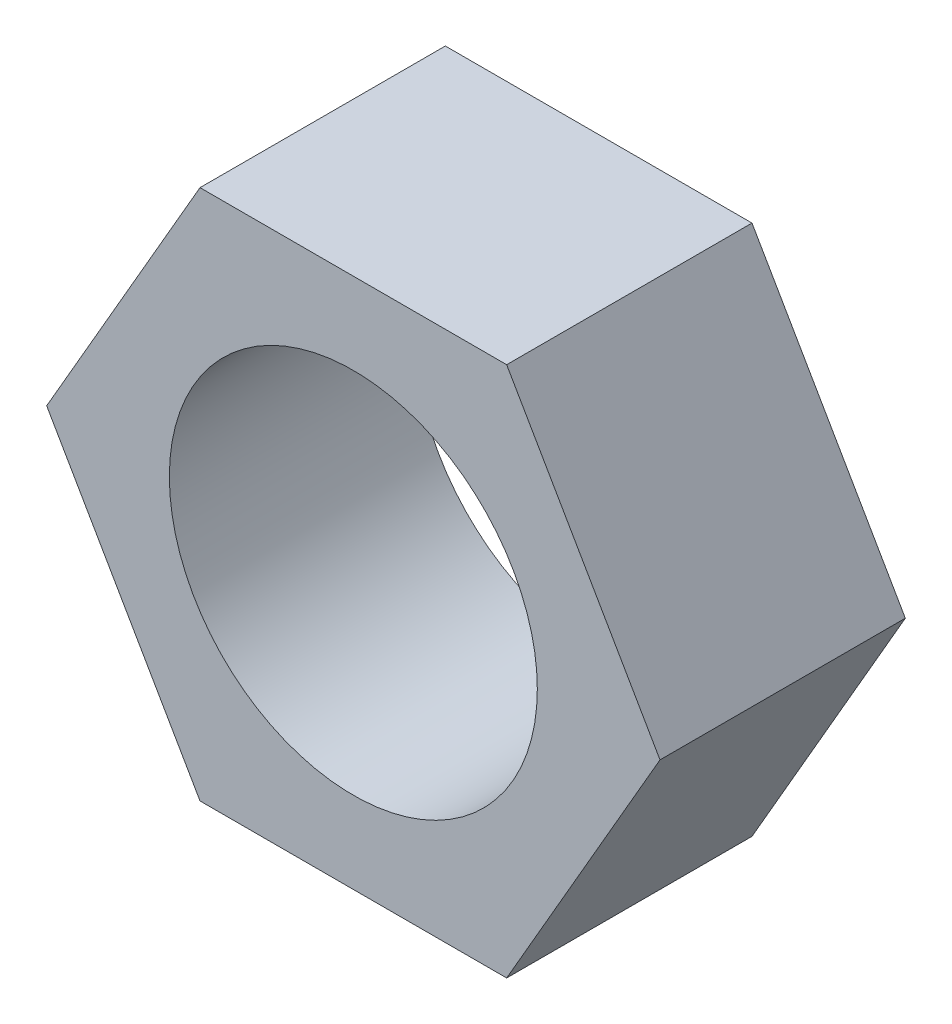
ISO-10303-21;
HEADER;
FILE_DESCRIPTION(('STEP AP214'),'2;1');
FILE_NAME('part.step','',(''),(''),'','','');
FILE_SCHEMA(('AUTOMOTIVE_DESIGN { 1 0 10303 214 1 1 1 1 }'));
ENDSEC;
DATA;
#1=APPLICATION_CONTEXT('core data for automotive mechanical design processes');
#2=APPLICATION_PROTOCOL_DEFINITION('international standard','automotive_design',2000,#1);
#3=PRODUCT_CONTEXT('',#1,'mechanical');
#4=PRODUCT('Part','Part','',(#3));
#5=PRODUCT_RELATED_PRODUCT_CATEGORY('part','',(#4));
#6=PRODUCT_DEFINITION_FORMATION('','',#4);
#7=PRODUCT_DEFINITION_CONTEXT('part definition',#1,'design');
#8=PRODUCT_DEFINITION('design','',#6,#7);
#9=PRODUCT_DEFINITION_SHAPE('','',#8);
#10=(LENGTH_UNIT() NAMED_UNIT(*) SI_UNIT(.MILLI.,.METRE.));
#11=(NAMED_UNIT(*) PLANE_ANGLE_UNIT() SI_UNIT($,.RADIAN.));
#12=(NAMED_UNIT(*) SI_UNIT($,.STERADIAN.) SOLID_ANGLE_UNIT());
#13=UNCERTAINTY_MEASURE_WITH_UNIT(LENGTH_MEASURE(1.E-05),#10,'distance_accuracy_value','');
#14=(GEOMETRIC_REPRESENTATION_CONTEXT(3) GLOBAL_UNCERTAINTY_ASSIGNED_CONTEXT((#13)) GLOBAL_UNIT_ASSIGNED_CONTEXT((#10,
#11,#12)) REPRESENTATION_CONTEXT('',''));
#15=CARTESIAN_POINT('',(0.,0.,0.));
#16=DIRECTION('',(0.,0.,1.));
#17=DIRECTION('',(1.,0.,0.));
#18=AXIS2_PLACEMENT_3D('',#15,#16,#17);
#19=CARTESIAN_POINT('',(2.50000000000005,-4.33012701892216,4.));
#20=DIRECTION('',(-0.866025403784442,0.499999999999995,0.));
#21=DIRECTION('',(-0.499999999999995,-0.866025403784442,0.));
#22=AXIS2_PLACEMENT_3D('',#19,#20,#21);
#23=PLANE('',#22);
#24=DIRECTION('',(0.499999999999995,0.866025403784442,0.));
#25=VECTOR('',#24,1.);
#26=CARTESIAN_POINT('',(2.50000000000005,-4.33012701892216,0.));
#27=LINE('',#26,#25);
#28=CARTESIAN_POINT('',(2.50000000000005,-4.33012701892216,0.));
#29=VERTEX_POINT('',#28);
#30=CARTESIAN_POINT('',(5.,0.,0.));
#31=VERTEX_POINT('',#30);
#32=EDGE_CURVE('E118',#29,#31,#27,.T.);
#33=ORIENTED_EDGE('',*,*,#32,.T.);
#34=DIRECTION('',(0.,0.,-1.));
#35=VECTOR('',#34,1.);
#36=CARTESIAN_POINT('',(5.,0.,4.));
#37=LINE('',#36,#35);
#38=CARTESIAN_POINT('',(5.,0.,4.));
#39=VERTEX_POINT('',#38);
#40=EDGE_CURVE('E11',#39,#31,#37,.T.);
#41=ORIENTED_EDGE('',*,*,#40,.F.);
#42=DIRECTION('',(0.499999999999995,0.866025403784442,0.));
#43=VECTOR('',#42,1.);
#44=CARTESIAN_POINT('',(2.50000000000005,-4.33012701892216,4.));
#45=LINE('',#44,#43);
#46=CARTESIAN_POINT('',(2.50000000000005,-4.33012701892216,4.));
#47=VERTEX_POINT('',#46);
#48=EDGE_CURVE('E129',#47,#39,#45,.T.);
#49=ORIENTED_EDGE('',*,*,#48,.F.);
#50=DIRECTION('',(0.,0.,-1.));
#51=VECTOR('',#50,1.);
#52=CARTESIAN_POINT('',(2.50000000000005,-4.33012701892216,4.));
#53=LINE('',#52,#51);
#54=EDGE_CURVE('E114',#47,#29,#53,.T.);
#55=ORIENTED_EDGE('',*,*,#54,.T.);
#56=EDGE_LOOP('',(#33,#41,#49,#55));
#57=FACE_BOUND('',#56,.T.);
#58=ADVANCED_FACE('F34',(#57),#23,.F.);
#59=CARTESIAN_POINT('',(5.,0.,4.));
#60=DIRECTION('',(-0.866025403784438,-0.500000000000001,0.));
#61=DIRECTION('',(0.500000000000001,-0.866025403784438,0.));
#62=AXIS2_PLACEMENT_3D('',#59,#60,#61);
#63=PLANE('',#62);
#64=DIRECTION('',(-0.500000000000001,0.866025403784438,0.));
#65=VECTOR('',#64,1.);
#66=CARTESIAN_POINT('',(5.,0.,0.));
#67=LINE('',#66,#65);
#68=CARTESIAN_POINT('',(2.49999999999999,4.3301270189222,0.));
#69=VERTEX_POINT('',#68);
#70=EDGE_CURVE('E121',#31,#69,#67,.T.);
#71=ORIENTED_EDGE('',*,*,#70,.T.);
#72=DIRECTION('',(0.,0.,-1.));
#73=VECTOR('',#72,1.);
#74=CARTESIAN_POINT('',(2.49999999999999,4.3301270189222,4.));
#75=LINE('',#74,#73);
#76=CARTESIAN_POINT('',(2.49999999999999,4.3301270189222,4.));
#77=VERTEX_POINT('',#76);
#78=EDGE_CURVE('E42',#77,#69,#75,.T.);
#79=ORIENTED_EDGE('',*,*,#78,.F.);
#80=DIRECTION('',(-0.500000000000001,0.866025403784438,0.));
#81=VECTOR('',#80,1.);
#82=CARTESIAN_POINT('',(5.,0.,4.));
#83=LINE('',#82,#81);
#84=EDGE_CURVE('E87',#39,#77,#83,.T.);
#85=ORIENTED_EDGE('',*,*,#84,.F.);
#86=ORIENTED_EDGE('',*,*,#40,.T.);
#87=EDGE_LOOP('',(#71,#79,#85,#86));
#88=FACE_BOUND('',#87,.T.);
#89=ADVANCED_FACE('F154',(#88),#63,.F.);
#90=CARTESIAN_POINT('',(2.49999999999999,4.3301270189222,4.));
#91=DIRECTION('',(0.,-1.,0.));
#92=DIRECTION('',(1.,0.,0.));
#93=AXIS2_PLACEMENT_3D('',#90,#91,#92);
#94=PLANE('',#93);
#95=DIRECTION('',(-1.,0.,0.));
#96=VECTOR('',#95,1.);
#97=CARTESIAN_POINT('',(2.49999999999999,4.3301270189222,0.));
#98=LINE('',#97,#96);
#99=CARTESIAN_POINT('',(-2.50000000000002,4.33012701892218,0.));
#100=VERTEX_POINT('',#99);
#101=EDGE_CURVE('E124',#69,#100,#98,.T.);
#102=ORIENTED_EDGE('',*,*,#101,.T.);
#103=DIRECTION('',(0.,0.,-1.));
#104=VECTOR('',#103,1.);
#105=CARTESIAN_POINT('',(-2.50000000000002,4.33012701892218,4.));
#106=LINE('',#105,#104);
#107=CARTESIAN_POINT('',(-2.50000000000002,4.33012701892218,4.));
#108=VERTEX_POINT('',#107);
#109=EDGE_CURVE('E109',#108,#100,#106,.T.);
#110=ORIENTED_EDGE('',*,*,#109,.F.);
#111=DIRECTION('',(-1.,0.,0.));
#112=VECTOR('',#111,1.);
#113=CARTESIAN_POINT('',(2.49999999999999,4.3301270189222,4.));
#114=LINE('',#113,#112);
#115=EDGE_CURVE('E100',#77,#108,#114,.T.);
#116=ORIENTED_EDGE('',*,*,#115,.F.);
#117=ORIENTED_EDGE('',*,*,#78,.T.);
#118=EDGE_LOOP('',(#102,#110,#116,#117));
#119=FACE_BOUND('',#118,.T.);
#120=ADVANCED_FACE('F135',(#119),#94,.F.);
#121=CARTESIAN_POINT('',(-2.50000000000002,4.33012701892218,4.));
#122=DIRECTION('',(0.866025403784442,-0.499999999999995,0.));
#123=DIRECTION('',(0.499999999999995,0.866025403784442,0.));
#124=AXIS2_PLACEMENT_3D('',#121,#122,#123);
#125=PLANE('',#124);
#126=DIRECTION('',(-0.499999999999995,-0.866025403784442,0.));
#127=VECTOR('',#126,1.);
#128=CARTESIAN_POINT('',(-2.50000000000002,4.33012701892218,0.));
#129=LINE('',#128,#127);
#130=CARTESIAN_POINT('',(-5.,0.,0.));
#131=VERTEX_POINT('',#130);
#132=EDGE_CURVE('E108',#100,#131,#129,.T.);
#133=ORIENTED_EDGE('',*,*,#132,.T.);
#134=DIRECTION('',(0.,0.,-1.));
#135=VECTOR('',#134,1.);
#136=CARTESIAN_POINT('',(-5.,0.,4.));
#137=LINE('',#136,#135);
#138=CARTESIAN_POINT('',(-5.,0.,4.));
#139=VERTEX_POINT('',#138);
#140=EDGE_CURVE('E105',#139,#131,#137,.T.);
#141=ORIENTED_EDGE('',*,*,#140,.F.);
#142=DIRECTION('',(-0.499999999999995,-0.866025403784442,0.));
#143=VECTOR('',#142,1.);
#144=CARTESIAN_POINT('',(-2.50000000000002,4.33012701892218,4.));
#145=LINE('',#144,#143);
#146=EDGE_CURVE('E94',#108,#139,#145,.T.);
#147=ORIENTED_EDGE('',*,*,#146,.F.);
#148=ORIENTED_EDGE('',*,*,#109,.T.);
#149=EDGE_LOOP('',(#133,#141,#147,#148));
#150=FACE_BOUND('',#149,.T.);
#151=ADVANCED_FACE('F106',(#150),#125,.F.);
#152=CARTESIAN_POINT('',(-5.,0.,4.));
#153=DIRECTION('',(0.866025403784435,0.500000000000007,0.));
#154=DIRECTION('',(-0.500000000000007,0.866025403784435,0.));
#155=AXIS2_PLACEMENT_3D('',#152,#153,#154);
#156=PLANE('',#155);
#157=DIRECTION('',(0.500000000000007,-0.866025403784435,0.));
#158=VECTOR('',#157,1.);
#159=CARTESIAN_POINT('',(-5.,0.,0.));
#160=LINE('',#159,#158);
#161=CARTESIAN_POINT('',(-2.49999999999996,-4.33012701892222,0.));
#162=VERTEX_POINT('',#161);
#163=EDGE_CURVE('E73',#131,#162,#160,.T.);
#164=ORIENTED_EDGE('',*,*,#163,.T.);
#165=DIRECTION('',(0.,0.,-1.));
#166=VECTOR('',#165,1.);
#167=CARTESIAN_POINT('',(-2.49999999999996,-4.33012701892222,4.));
#168=LINE('',#167,#166);
#169=CARTESIAN_POINT('',(-2.49999999999996,-4.33012701892222,4.));
#170=VERTEX_POINT('',#169);
#171=EDGE_CURVE('E110',#170,#162,#168,.T.);
#172=ORIENTED_EDGE('',*,*,#171,.F.);
#173=DIRECTION('',(0.500000000000007,-0.866025403784435,0.));
#174=VECTOR('',#173,1.);
#175=CARTESIAN_POINT('',(-5.,0.,4.));
#176=LINE('',#175,#174);
#177=EDGE_CURVE('E98',#139,#170,#176,.T.);
#178=ORIENTED_EDGE('',*,*,#177,.F.);
#179=ORIENTED_EDGE('',*,*,#140,.T.);
#180=EDGE_LOOP('',(#164,#172,#178,#179));
#181=FACE_BOUND('',#180,.T.);
#182=ADVANCED_FACE('F112',(#181),#156,.F.);
#183=CARTESIAN_POINT('',(-2.49999999999996,-4.33012701892222,4.));
#184=DIRECTION('',(0.,1.,0.));
#185=DIRECTION('',(-1.,0.,0.));
#186=AXIS2_PLACEMENT_3D('',#183,#184,#185);
#187=PLANE('',#186);
#188=DIRECTION('',(1.,0.,0.));
#189=VECTOR('',#188,1.);
#190=CARTESIAN_POINT('',(-2.49999999999996,-4.33012701892222,0.));
#191=LINE('',#190,#189);
#192=EDGE_CURVE('E79',#162,#29,#191,.T.);
#193=ORIENTED_EDGE('',*,*,#192,.T.);
#194=ORIENTED_EDGE('',*,*,#54,.F.);
#195=DIRECTION('',(1.,0.,0.));
#196=VECTOR('',#195,1.);
#197=CARTESIAN_POINT('',(-2.49999999999996,-4.33012701892222,4.));
#198=LINE('',#197,#196);
#199=EDGE_CURVE('E50',#170,#47,#198,.T.);
#200=ORIENTED_EDGE('',*,*,#199,.F.);
#201=ORIENTED_EDGE('',*,*,#171,.T.);
#202=EDGE_LOOP('',(#193,#194,#200,#201));
#203=FACE_BOUND('',#202,.T.);
#204=ADVANCED_FACE('F142',(#203),#187,.F.);
#205=CARTESIAN_POINT('',(0.,0.,4.));
#206=DIRECTION('',(0.,0.,1.));
#207=DIRECTION('',(1.,0.,0.));
#208=AXIS2_PLACEMENT_3D('',#205,#206,#207);
#209=PLANE('',#208);
#210=CARTESIAN_POINT('',(0.,0.,4.));
#211=DIRECTION('',(0.,0.,-1.));
#212=DIRECTION('',(-1.,0.,0.));
#213=AXIS2_PLACEMENT_3D('',#210,#211,#212);
#214=CIRCLE('',#213,3.);
#215=CARTESIAN_POINT('',(-3.,0.,4.));
#216=VERTEX_POINT('',#215);
#217=EDGE_CURVE('E122',#216,#216,#214,.T.);
#218=ORIENTED_EDGE('',*,*,#217,.T.);
#219=EDGE_LOOP('',(#218));
#220=FACE_BOUND('',#219,.T.);
#221=ORIENTED_EDGE('',*,*,#48,.T.);
#222=ORIENTED_EDGE('',*,*,#84,.T.);
#223=ORIENTED_EDGE('',*,*,#115,.T.);
#224=ORIENTED_EDGE('',*,*,#146,.T.);
#225=ORIENTED_EDGE('',*,*,#177,.T.);
#226=ORIENTED_EDGE('',*,*,#199,.T.);
#227=EDGE_LOOP('',(#221,#222,#223,#224,#225,#226));
#228=FACE_BOUND('',#227,.T.);
#229=ADVANCED_FACE('F96',(#220,#228),#209,.T.);
#230=CARTESIAN_POINT('',(0.,0.,0.));
#231=DIRECTION('',(0.,0.,1.));
#232=DIRECTION('',(1.,0.,0.));
#233=AXIS2_PLACEMENT_3D('',#230,#231,#232);
#234=PLANE('',#233);
#235=CARTESIAN_POINT('',(0.,0.,0.));
#236=DIRECTION('',(0.,0.,-1.));
#237=DIRECTION('',(-1.,0.,0.));
#238=AXIS2_PLACEMENT_3D('',#235,#236,#237);
#239=CIRCLE('',#238,3.);
#240=CARTESIAN_POINT('',(-3.,0.,0.));
#241=VERTEX_POINT('',#240);
#242=EDGE_CURVE('E209',#241,#241,#239,.T.);
#243=ORIENTED_EDGE('',*,*,#242,.F.);
#244=EDGE_LOOP('',(#243));
#245=FACE_BOUND('',#244,.T.);
#246=ORIENTED_EDGE('',*,*,#32,.F.);
#247=ORIENTED_EDGE('',*,*,#192,.F.);
#248=ORIENTED_EDGE('',*,*,#163,.F.);
#249=ORIENTED_EDGE('',*,*,#132,.F.);
#250=ORIENTED_EDGE('',*,*,#101,.F.);
#251=ORIENTED_EDGE('',*,*,#70,.F.);
#252=EDGE_LOOP('',(#246,#247,#248,#249,#250,#251));
#253=FACE_BOUND('',#252,.T.);
#254=ADVANCED_FACE('F138',(#245,#253),#234,.F.);
#255=CARTESIAN_POINT('',(0.,0.,4.));
#256=DIRECTION('',(0.,0.,-1.));
#257=DIRECTION('',(-1.,0.,0.));
#258=AXIS2_PLACEMENT_3D('',#255,#256,#257);
#259=CYLINDRICAL_SURFACE('',#258,3.);
#260=ORIENTED_EDGE('',*,*,#217,.F.);
#261=EDGE_LOOP('',(#260));
#262=FACE_BOUND('',#261,.T.);
#263=ORIENTED_EDGE('',*,*,#242,.T.);
#264=EDGE_LOOP('',(#263));
#265=FACE_BOUND('',#264,.T.);
#266=ADVANCED_FACE('F191',(#262,#265),#259,.F.);
#267=CLOSED_SHELL('',(#58,#89,#120,#151,#182,#204,#229,#254,#266));
#268=MANIFOLD_SOLID_BREP('B2',#267);
#269=ADVANCED_BREP_SHAPE_REPRESENTATION('',(#18,#268),#14);
#270=SHAPE_DEFINITION_REPRESENTATION(#9,#269);
ENDSEC;
END-ISO-10303-21;
